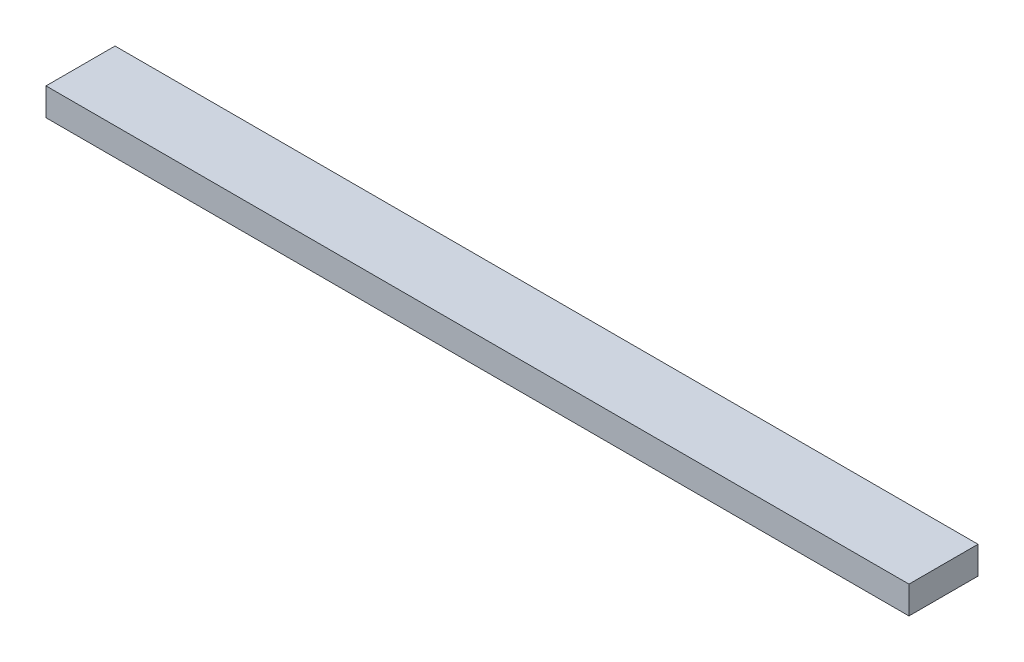
ISO-10303-21;
HEADER;
FILE_DESCRIPTION(('STEP AP214'),'2;1');
FILE_NAME('part.step','',(''),(''),'','','');
FILE_SCHEMA(('AUTOMOTIVE_DESIGN { 1 0 10303 214 1 1 1 1 }'));
ENDSEC;
DATA;
#1=APPLICATION_CONTEXT('core data for automotive mechanical design processes');
#2=APPLICATION_PROTOCOL_DEFINITION('international standard','automotive_design',2000,#1);
#3=PRODUCT_CONTEXT('',#1,'mechanical');
#4=PRODUCT('Part','Part','',(#3));
#5=PRODUCT_RELATED_PRODUCT_CATEGORY('part','',(#4));
#6=PRODUCT_DEFINITION_FORMATION('','',#4);
#7=PRODUCT_DEFINITION_CONTEXT('part definition',#1,'design');
#8=PRODUCT_DEFINITION('design','',#6,#7);
#9=PRODUCT_DEFINITION_SHAPE('','',#8);
#10=(LENGTH_UNIT() NAMED_UNIT(*) SI_UNIT(.MILLI.,.METRE.));
#11=(NAMED_UNIT(*) PLANE_ANGLE_UNIT() SI_UNIT($,.RADIAN.));
#12=(NAMED_UNIT(*) SI_UNIT($,.STERADIAN.) SOLID_ANGLE_UNIT());
#13=UNCERTAINTY_MEASURE_WITH_UNIT(LENGTH_MEASURE(1.E-05),#10,'distance_accuracy_value','');
#14=(GEOMETRIC_REPRESENTATION_CONTEXT(3) GLOBAL_UNCERTAINTY_ASSIGNED_CONTEXT((#13)) GLOBAL_UNIT_ASSIGNED_CONTEXT((#10,
#11,#12)) REPRESENTATION_CONTEXT('',''));
#15=CARTESIAN_POINT('',(0.,0.,0.));
#16=DIRECTION('',(0.,0.,1.));
#17=DIRECTION('',(1.,0.,0.));
#18=AXIS2_PLACEMENT_3D('',#15,#16,#17);
#19=CARTESIAN_POINT('',(-25.,1.6,2.00000000000001));
#20=DIRECTION('',(1.,0.,0.));
#21=DIRECTION('',(0.,0.,-1.));
#22=AXIS2_PLACEMENT_3D('',#19,#20,#21);
#23=PLANE('',#22);
#24=DIRECTION('',(0.,0.,1.));
#25=VECTOR('',#24,1.);
#26=CARTESIAN_POINT('',(-25.,0.,2.00000000000001));
#27=LINE('',#26,#25);
#28=CARTESIAN_POINT('',(-25.,0.,-2.));
#29=VERTEX_POINT('',#28);
#30=CARTESIAN_POINT('',(-25.,0.,2.00000000000001));
#31=VERTEX_POINT('',#30);
#32=EDGE_CURVE('E107',#29,#31,#27,.T.);
#33=ORIENTED_EDGE('',*,*,#32,.T.);
#34=DIRECTION('',(0.,-1.,0.));
#35=VECTOR('',#34,1.);
#36=CARTESIAN_POINT('',(-25.,1.6,2.00000000000001));
#37=LINE('',#36,#35);
#38=CARTESIAN_POINT('',(-25.,1.6,2.00000000000001));
#39=VERTEX_POINT('',#38);
#40=EDGE_CURVE('E11',#39,#31,#37,.T.);
#41=ORIENTED_EDGE('',*,*,#40,.F.);
#42=DIRECTION('',(0.,0.,1.));
#43=VECTOR('',#42,1.);
#44=CARTESIAN_POINT('',(-25.,1.6,2.00000000000001));
#45=LINE('',#44,#43);
#46=CARTESIAN_POINT('',(-25.,1.6,-2.));
#47=VERTEX_POINT('',#46);
#48=EDGE_CURVE('E91',#47,#39,#45,.T.);
#49=ORIENTED_EDGE('',*,*,#48,.F.);
#50=DIRECTION('',(0.,-1.,0.));
#51=VECTOR('',#50,1.);
#52=CARTESIAN_POINT('',(-25.,1.6,-2.));
#53=LINE('',#52,#51);
#54=EDGE_CURVE('E103',#47,#29,#53,.T.);
#55=ORIENTED_EDGE('',*,*,#54,.T.);
#56=EDGE_LOOP('',(#33,#41,#49,#55));
#57=FACE_BOUND('',#56,.T.);
#58=ADVANCED_FACE('F39',(#57),#23,.F.);
#59=CARTESIAN_POINT('',(25.,1.6,2.));
#60=DIRECTION('',(0.,0.,-1.));
#61=DIRECTION('',(-1.,0.,0.));
#62=AXIS2_PLACEMENT_3D('',#59,#60,#61);
#63=PLANE('',#62);
#64=DIRECTION('',(1.,0.,0.));
#65=VECTOR('',#64,1.);
#66=CARTESIAN_POINT('',(25.,0.,2.));
#67=LINE('',#66,#65);
#68=CARTESIAN_POINT('',(25.,0.,2.));
#69=VERTEX_POINT('',#68);
#70=EDGE_CURVE('E96',#31,#69,#67,.T.);
#71=ORIENTED_EDGE('',*,*,#70,.T.);
#72=DIRECTION('',(0.,-1.,0.));
#73=VECTOR('',#72,1.);
#74=CARTESIAN_POINT('',(25.,1.6,2.));
#75=LINE('',#74,#73);
#76=CARTESIAN_POINT('',(25.,1.6,2.));
#77=VERTEX_POINT('',#76);
#78=EDGE_CURVE('E48',#77,#69,#75,.T.);
#79=ORIENTED_EDGE('',*,*,#78,.F.);
#80=DIRECTION('',(1.,0.,0.));
#81=VECTOR('',#80,1.);
#82=CARTESIAN_POINT('',(25.,1.6,2.));
#83=LINE('',#82,#81);
#84=EDGE_CURVE('E86',#39,#77,#83,.T.);
#85=ORIENTED_EDGE('',*,*,#84,.F.);
#86=ORIENTED_EDGE('',*,*,#40,.T.);
#87=EDGE_LOOP('',(#71,#79,#85,#86));
#88=FACE_BOUND('',#87,.T.);
#89=ADVANCED_FACE('F95',(#88),#63,.F.);
#90=CARTESIAN_POINT('',(25.,1.6,2.));
#91=DIRECTION('',(-1.,0.,0.));
#92=DIRECTION('',(0.,0.,1.));
#93=AXIS2_PLACEMENT_3D('',#90,#91,#92);
#94=PLANE('',#93);
#95=DIRECTION('',(0.,0.,-1.));
#96=VECTOR('',#95,1.);
#97=CARTESIAN_POINT('',(25.,0.,2.));
#98=LINE('',#97,#96);
#99=CARTESIAN_POINT('',(25.,0.,-2.));
#100=VERTEX_POINT('',#99);
#101=EDGE_CURVE('E73',#69,#100,#98,.T.);
#102=ORIENTED_EDGE('',*,*,#101,.T.);
#103=DIRECTION('',(0.,-1.,0.));
#104=VECTOR('',#103,1.);
#105=CARTESIAN_POINT('',(25.,1.6,-2.));
#106=LINE('',#105,#104);
#107=CARTESIAN_POINT('',(25.,1.6,-2.));
#108=VERTEX_POINT('',#107);
#109=EDGE_CURVE('E98',#108,#100,#106,.T.);
#110=ORIENTED_EDGE('',*,*,#109,.F.);
#111=DIRECTION('',(0.,0.,-1.));
#112=VECTOR('',#111,1.);
#113=CARTESIAN_POINT('',(25.,1.6,2.));
#114=LINE('',#113,#112);
#115=EDGE_CURVE('E89',#77,#108,#114,.T.);
#116=ORIENTED_EDGE('',*,*,#115,.F.);
#117=ORIENTED_EDGE('',*,*,#78,.T.);
#118=EDGE_LOOP('',(#102,#110,#116,#117));
#119=FACE_BOUND('',#118,.T.);
#120=ADVANCED_FACE('F99',(#119),#94,.F.);
#121=CARTESIAN_POINT('',(25.,1.6,-2.));
#122=DIRECTION('',(0.,0.,1.));
#123=DIRECTION('',(1.,0.,0.));
#124=AXIS2_PLACEMENT_3D('',#121,#122,#123);
#125=PLANE('',#124);
#126=DIRECTION('',(-1.,0.,0.));
#127=VECTOR('',#126,1.);
#128=CARTESIAN_POINT('',(25.,0.,-2.));
#129=LINE('',#128,#127);
#130=EDGE_CURVE('E79',#100,#29,#129,.T.);
#131=ORIENTED_EDGE('',*,*,#130,.T.);
#132=ORIENTED_EDGE('',*,*,#54,.F.);
#133=DIRECTION('',(-1.,0.,0.));
#134=VECTOR('',#133,1.);
#135=CARTESIAN_POINT('',(25.,1.6,-2.));
#136=LINE('',#135,#134);
#137=EDGE_CURVE('E56',#108,#47,#136,.T.);
#138=ORIENTED_EDGE('',*,*,#137,.F.);
#139=ORIENTED_EDGE('',*,*,#109,.T.);
#140=EDGE_LOOP('',(#131,#132,#138,#139));
#141=FACE_BOUND('',#140,.T.);
#142=ADVANCED_FACE('F120',(#141),#125,.F.);
#143=CARTESIAN_POINT('',(0.,1.6,0.));
#144=DIRECTION('',(0.,1.,0.));
#145=DIRECTION('',(0.,0.,1.));
#146=AXIS2_PLACEMENT_3D('',#143,#144,#145);
#147=PLANE('',#146);
#148=ORIENTED_EDGE('',*,*,#48,.T.);
#149=ORIENTED_EDGE('',*,*,#84,.T.);
#150=ORIENTED_EDGE('',*,*,#115,.T.);
#151=ORIENTED_EDGE('',*,*,#137,.T.);
#152=EDGE_LOOP('',(#148,#149,#150,#151));
#153=FACE_BOUND('',#152,.T.);
#154=ADVANCED_FACE('F87',(#153),#147,.T.);
#155=CARTESIAN_POINT('',(0.,0.,0.));
#156=DIRECTION('',(0.,1.,0.));
#157=DIRECTION('',(0.,0.,1.));
#158=AXIS2_PLACEMENT_3D('',#155,#156,#157);
#159=PLANE('',#158);
#160=ORIENTED_EDGE('',*,*,#32,.F.);
#161=ORIENTED_EDGE('',*,*,#130,.F.);
#162=ORIENTED_EDGE('',*,*,#101,.F.);
#163=ORIENTED_EDGE('',*,*,#70,.F.);
#164=EDGE_LOOP('',(#160,#161,#162,#163));
#165=FACE_BOUND('',#164,.T.);
#166=ADVANCED_FACE('F123',(#165),#159,.F.);
#167=CLOSED_SHELL('',(#58,#89,#120,#142,#154,#166));
#168=MANIFOLD_SOLID_BREP('B2',#167);
#169=ADVANCED_BREP_SHAPE_REPRESENTATION('',(#18,#168),#14);
#170=SHAPE_DEFINITION_REPRESENTATION(#9,#169);
ENDSEC;
END-ISO-10303-21;
